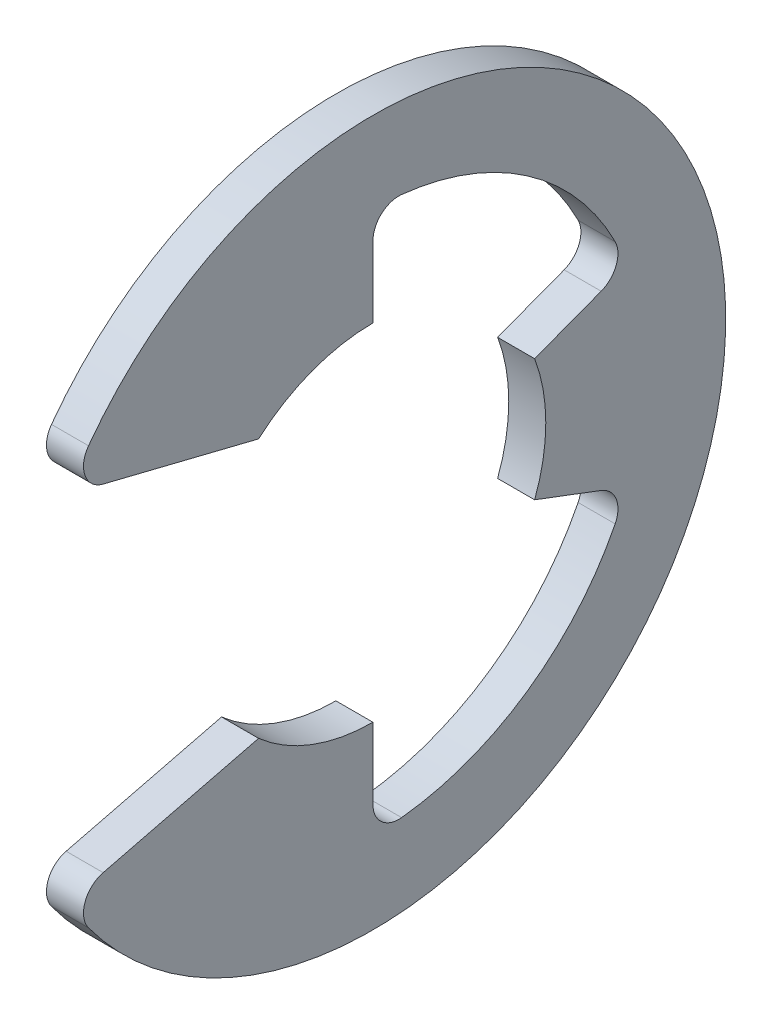
ISO-10303-21;
HEADER;
FILE_DESCRIPTION(('STEP AP214'),'2;1');
FILE_NAME('part.step','',(''),(''),'','','');
FILE_SCHEMA(('AUTOMOTIVE_DESIGN { 1 0 10303 214 1 1 1 1 }'));
ENDSEC;
DATA;
#1=APPLICATION_CONTEXT('core data for automotive mechanical design processes');
#2=APPLICATION_PROTOCOL_DEFINITION('international standard','automotive_design',2000,#1);
#3=PRODUCT_CONTEXT('',#1,'mechanical');
#4=PRODUCT('Part','Part','',(#3));
#5=PRODUCT_RELATED_PRODUCT_CATEGORY('part','',(#4));
#6=PRODUCT_DEFINITION_FORMATION('','',#4);
#7=PRODUCT_DEFINITION_CONTEXT('part definition',#1,'design');
#8=PRODUCT_DEFINITION('design','',#6,#7);
#9=PRODUCT_DEFINITION_SHAPE('','',#8);
#10=(LENGTH_UNIT() NAMED_UNIT(*) SI_UNIT(.MILLI.,.METRE.));
#11=(NAMED_UNIT(*) PLANE_ANGLE_UNIT() SI_UNIT($,.RADIAN.));
#12=(NAMED_UNIT(*) SI_UNIT($,.STERADIAN.) SOLID_ANGLE_UNIT());
#13=UNCERTAINTY_MEASURE_WITH_UNIT(LENGTH_MEASURE(1.E-05),#10,'distance_accuracy_value','');
#14=(GEOMETRIC_REPRESENTATION_CONTEXT(3) GLOBAL_UNCERTAINTY_ASSIGNED_CONTEXT((#13)) GLOBAL_UNIT_ASSIGNED_CONTEXT((#10,
#11,#12)) REPRESENTATION_CONTEXT('',''));
#15=CARTESIAN_POINT('',(0.,0.,0.));
#16=DIRECTION('',(0.,0.,1.));
#17=DIRECTION('',(1.,0.,0.));
#18=AXIS2_PLACEMENT_3D('',#15,#16,#17);
#19=CARTESIAN_POINT('',(0.533399999999962,0.,0.));
#20=DIRECTION('',(-1.,0.,0.));
#21=DIRECTION('',(0.,0.,1.00000000000001));
#22=AXIS2_PLACEMENT_3D('',#19,#20,#21);
#23=CYLINDRICAL_SURFACE('',#22,10.16);
#24=CARTESIAN_POINT('',(0.533399999999962,0.,0.));
#25=DIRECTION('',(1.,0.,0.));
#26=DIRECTION('',(0.,0.,-1.00000000000001));
#27=AXIS2_PLACEMENT_3D('',#24,#25,#26);
#28=CIRCLE('',#27,10.16);
#29=CARTESIAN_POINT('',(0.533399999999962,-6.01157023801036,8.19064242129236));
#30=VERTEX_POINT('',#29);
#31=CARTESIAN_POINT('',(0.533399999999962,6.0115702380106,8.19064242129246));
#32=VERTEX_POINT('',#31);
#33=EDGE_CURVE('E172',#30,#32,#28,.T.);
#34=ORIENTED_EDGE('',*,*,#33,.F.);
#35=DIRECTION('',(-1.,0.,0.));
#36=VECTOR('',#35,1.);
#37=CARTESIAN_POINT('',(0.533399999999962,-6.01157023801036,8.19064242129236));
#38=LINE('',#37,#36);
#39=CARTESIAN_POINT('',(-0.533400000000017,-6.01157023801036,8.19064242129236));
#40=VERTEX_POINT('',#39);
#41=EDGE_CURVE('E266',#30,#40,#38,.T.);
#42=ORIENTED_EDGE('',*,*,#41,.T.);
#43=CARTESIAN_POINT('',(-0.533399999999962,0.,0.));
#44=DIRECTION('',(1.,0.,0.));
#45=DIRECTION('',(0.,0.,-1.00000000000001));
#46=AXIS2_PLACEMENT_3D('',#43,#44,#45);
#47=CIRCLE('',#46,10.16);
#48=CARTESIAN_POINT('',(-0.533400000000017,6.0115702380106,8.19064242129246));
#49=VERTEX_POINT('',#48);
#50=EDGE_CURVE('E210',#40,#49,#47,.T.);
#51=ORIENTED_EDGE('',*,*,#50,.T.);
#52=DIRECTION('',(-1.,0.,0.));
#53=VECTOR('',#52,1.);
#54=CARTESIAN_POINT('',(0.533399999999962,6.0115702380106,8.19064242129246));
#55=LINE('',#54,#53);
#56=EDGE_CURVE('E264',#49,#32,#55,.F.);
#57=ORIENTED_EDGE('',*,*,#56,.T.);
#58=EDGE_LOOP('',(#34,#42,#51,#57));
#59=FACE_BOUND('',#58,.T.);
#60=ADVANCED_FACE('F34',(#59),#23,.T.);
#61=CARTESIAN_POINT('',(0.533399999999962,5.09813480407845,8.78832302088706));
#62=DIRECTION('',(0.,0.970536829925373,-0.24095282060687));
#63=DIRECTION('',(0.,0.240952820606878,0.970536829925378));
#64=AXIS2_PLACEMENT_3D('',#61,#62,#63);
#65=PLANE('',#64);
#66=DIRECTION('',(0.,-0.240952820606878,-0.970536829925378));
#67=VECTOR('',#66,1.);
#68=CARTESIAN_POINT('',(0.533399999999962,5.09813480407845,8.78832302088706));
#69=LINE('',#68,#67);
#70=CARTESIAN_POINT('',(0.533399999999962,4.84496174240151,7.76856413164388));
#71=VERTEX_POINT('',#70);
#72=CARTESIAN_POINT('',(0.533399999999962,3.73380000000001,3.29290208175144));
#73=VERTEX_POINT('',#72);
#74=EDGE_CURVE('E158',#71,#73,#69,.T.);
#75=ORIENTED_EDGE('',*,*,#74,.F.);
#76=DIRECTION('',(-1.,0.,0.));
#77=VECTOR('',#76,1.);
#78=CARTESIAN_POINT('',(0.533399999999962,4.84496174240151,7.76856413164388));
#79=LINE('',#78,#77);
#80=CARTESIAN_POINT('',(-0.533400000000017,4.84496174240151,7.76856413164388));
#81=VERTEX_POINT('',#80);
#82=EDGE_CURVE('E278',#71,#81,#79,.T.);
#83=ORIENTED_EDGE('',*,*,#82,.T.);
#84=DIRECTION('',(0.,-0.240952820606878,-0.970536829925378));
#85=VECTOR('',#84,1.);
#86=CARTESIAN_POINT('',(-0.533400000000017,5.09813480407845,8.78832302088706));
#87=LINE('',#86,#85);
#88=CARTESIAN_POINT('',(-0.533400000000017,3.73380000000001,3.29290208175144));
#89=VERTEX_POINT('',#88);
#90=EDGE_CURVE('E178',#81,#89,#87,.T.);
#91=ORIENTED_EDGE('',*,*,#90,.T.);
#92=DIRECTION('',(-1.,0.,0.));
#93=VECTOR('',#92,1.);
#94=CARTESIAN_POINT('',(0.533399999999962,3.73380000000001,3.29290208175144));
#95=LINE('',#94,#93);
#96=EDGE_CURVE('E175',#73,#89,#95,.T.);
#97=ORIENTED_EDGE('',*,*,#96,.F.);
#98=EDGE_LOOP('',(#75,#83,#91,#97));
#99=FACE_BOUND('',#98,.T.);
#100=ADVANCED_FACE('F176',(#99),#65,.F.);
#101=CARTESIAN_POINT('',(0.533399999999962,0.,0.));
#102=DIRECTION('',(-1.,0.,0.));
#103=DIRECTION('',(0.,0.,1.00000000000001));
#104=AXIS2_PLACEMENT_3D('',#101,#102,#103);
#105=CYLINDRICAL_SURFACE('',#104,4.9784);
#106=CARTESIAN_POINT('',(-0.533399999999962,0.,0.));
#107=DIRECTION('',(-1.,0.,0.));
#108=DIRECTION('',(0.,0.,1.00000000000001));
#109=AXIS2_PLACEMENT_3D('',#106,#107,#108);
#110=CIRCLE('',#109,4.9784);
#111=CARTESIAN_POINT('',(-0.533400000000184,4.97840000000035,3.33066907387547E-13));
#112=VERTEX_POINT('',#111);
#113=EDGE_CURVE('E214',#89,#112,#110,.T.);
#114=ORIENTED_EDGE('',*,*,#113,.T.);
#115=DIRECTION('',(-1.,0.,0.));
#116=VECTOR('',#115,1.);
#117=CARTESIAN_POINT('',(0.533399999999795,4.97840000000035,3.33066907387547E-13));
#118=LINE('',#117,#116);
#119=CARTESIAN_POINT('',(0.533399999999795,4.97840000000035,3.33066907387547E-13));
#120=VERTEX_POINT('',#119);
#121=EDGE_CURVE('E182',#120,#112,#118,.T.);
#122=ORIENTED_EDGE('',*,*,#121,.F.);
#123=CARTESIAN_POINT('',(0.533399999999962,0.,0.));
#124=DIRECTION('',(-1.,0.,0.));
#125=DIRECTION('',(0.,0.,1.00000000000001));
#126=AXIS2_PLACEMENT_3D('',#123,#124,#125);
#127=CIRCLE('',#126,4.9784);
#128=EDGE_CURVE('E164',#73,#120,#127,.T.);
#129=ORIENTED_EDGE('',*,*,#128,.F.);
#130=ORIENTED_EDGE('',*,*,#96,.T.);
#131=EDGE_LOOP('',(#114,#122,#129,#130));
#132=FACE_BOUND('',#131,.T.);
#133=ADVANCED_FACE('F184',(#132),#105,.F.);
#134=CARTESIAN_POINT('',(0.533399999999795,4.97840000000035,3.33066907387547E-13));
#135=DIRECTION('',(0.,0.,1.00000000000001));
#136=DIRECTION('',(0.,-1.,0.));
#137=AXIS2_PLACEMENT_3D('',#134,#135,#136);
#138=PLANE('',#137);
#139=DIRECTION('',(0.,1.,0.));
#140=VECTOR('',#139,1.);
#141=CARTESIAN_POINT('',(-0.533400000000184,4.97840000000035,3.33066907387547E-13));
#142=LINE('',#141,#140);
#143=CARTESIAN_POINT('',(-0.533400000000184,7.02704023617218,3.33066907387547E-13));
#144=VERTEX_POINT('',#143);
#145=EDGE_CURVE('E216',#112,#144,#142,.T.);
#146=ORIENTED_EDGE('',*,*,#145,.T.);
#147=DIRECTION('',(1.,0.,0.));
#148=VECTOR('',#147,1.);
#149=CARTESIAN_POINT('',(0.533399999999795,7.02704023617218,3.33066907387547E-13));
#150=LINE('',#149,#148);
#151=CARTESIAN_POINT('',(0.533399999999795,7.02704023617218,3.33066907387547E-13));
#152=VERTEX_POINT('',#151);
#153=EDGE_CURVE('E262',#144,#152,#150,.T.);
#154=ORIENTED_EDGE('',*,*,#153,.T.);
#155=DIRECTION('',(0.,1.,0.));
#156=VECTOR('',#155,1.);
#157=CARTESIAN_POINT('',(0.533399999999795,4.97840000000035,3.33066907387547E-13));
#158=LINE('',#157,#156);
#159=EDGE_CURVE('E187',#120,#152,#158,.T.);
#160=ORIENTED_EDGE('',*,*,#159,.F.);
#161=ORIENTED_EDGE('',*,*,#121,.T.);
#162=EDGE_LOOP('',(#146,#154,#160,#161));
#163=FACE_BOUND('',#162,.T.);
#164=ADVANCED_FACE('F384',(#163),#138,.F.);
#165=CARTESIAN_POINT('',(0.533399999999962,0.,0.));
#166=DIRECTION('',(-1.,0.,0.));
#167=DIRECTION('',(0.,0.,1.00000000000001));
#168=AXIS2_PLACEMENT_3D('',#165,#166,#167);
#169=CYLINDRICAL_SURFACE('',#168,7.81336774193549);
#170=CARTESIAN_POINT('',(0.533399999999962,0.,0.));
#171=DIRECTION('',(-1.,0.,0.));
#172=DIRECTION('',(0.,0.,-1.00000000000001));
#173=AXIS2_PLACEMENT_3D('',#170,#171,#172);
#174=CIRCLE('',#173,7.81336774193549);
#175=CARTESIAN_POINT('',(0.533399999999962,7.76961896112755,-0.825673464276588));
#176=VERTEX_POINT('',#175);
#177=CARTESIAN_POINT('',(0.533400000000017,3.5193219314931,-6.97589339176204));
#178=VERTEX_POINT('',#177);
#179=EDGE_CURVE('E189',#176,#178,#174,.T.);
#180=ORIENTED_EDGE('',*,*,#179,.F.);
#181=DIRECTION('',(-1.,0.,0.));
#182=VECTOR('',#181,1.);
#183=CARTESIAN_POINT('',(0.533399999999962,7.76961896112755,-0.825673464276588));
#184=LINE('',#183,#182);
#185=CARTESIAN_POINT('',(-0.533400000000017,7.76961896112755,-0.825673464276616));
#186=VERTEX_POINT('',#185);
#187=EDGE_CURVE('E259',#176,#186,#184,.T.);
#188=ORIENTED_EDGE('',*,*,#187,.T.);
#189=CARTESIAN_POINT('',(-0.533399999999962,0.,0.));
#190=DIRECTION('',(-1.,0.,0.));
#191=DIRECTION('',(0.,0.,-1.00000000000001));
#192=AXIS2_PLACEMENT_3D('',#189,#190,#191);
#193=CIRCLE('',#192,7.81336774193549);
#194=CARTESIAN_POINT('',(-0.533400000000017,3.5193219314931,-6.97589339176204));
#195=VERTEX_POINT('',#194);
#196=EDGE_CURVE('E219',#186,#195,#193,.T.);
#197=ORIENTED_EDGE('',*,*,#196,.T.);
#198=DIRECTION('',(-1.,0.,0.));
#199=VECTOR('',#198,1.);
#200=CARTESIAN_POINT('',(0.533400000000017,3.5193219314931,-6.97589339176204));
#201=LINE('',#200,#199);
#202=EDGE_CURVE('E257',#195,#178,#201,.F.);
#203=ORIENTED_EDGE('',*,*,#202,.T.);
#204=EDGE_LOOP('',(#180,#188,#197,#203));
#205=FACE_BOUND('',#204,.T.);
#206=ADVANCED_FACE('F306',(#205),#169,.F.);
#207=CARTESIAN_POINT('',(0.533400000000017,1.76013019972987,-4.65686678357836));
#208=DIRECTION('',(0.,-0.935414346693487,-0.353553390593281));
#209=DIRECTION('',(0.,0.353553390593271,-0.935414346693489));
#210=AXIS2_PLACEMENT_3D('',#207,#208,#209);
#211=PLANE('',#210);
#212=DIRECTION('',(0.,-0.353553390593271,0.935414346693489));
#213=VECTOR('',#212,1.);
#214=CARTESIAN_POINT('',(0.533400000000017,1.76013019972987,-4.65686678357836));
#215=LINE('',#214,#213);
#216=CARTESIAN_POINT('',(0.533400000000017,2.48443390133452,-6.57319425170749));
#217=VERTEX_POINT('',#216);
#218=CARTESIAN_POINT('',(0.533400000000017,1.76013019972987,-4.65686678357836));
#219=VERTEX_POINT('',#218);
#220=EDGE_CURVE('E194',#217,#219,#215,.T.);
#221=ORIENTED_EDGE('',*,*,#220,.F.);
#222=DIRECTION('',(1.,0.,0.));
#223=VECTOR('',#222,1.);
#224=CARTESIAN_POINT('',(-0.533400000000017,2.48443390133452,-6.57319425170749));
#225=LINE('',#224,#223);
#226=CARTESIAN_POINT('',(-0.533400000000017,2.48443390133452,-6.57319425170749));
#227=VERTEX_POINT('',#226);
#228=EDGE_CURVE('E281',#217,#227,#225,.F.);
#229=ORIENTED_EDGE('',*,*,#228,.T.);
#230=DIRECTION('',(0.,-0.353553390593271,0.935414346693489));
#231=VECTOR('',#230,1.);
#232=CARTESIAN_POINT('',(-0.533400000000017,1.76013019972987,-4.65686678357831));
#233=LINE('',#232,#231);
#234=CARTESIAN_POINT('',(-0.533400000000017,1.76013019972987,-4.65686678357831));
#235=VERTEX_POINT('',#234);
#236=EDGE_CURVE('E222',#227,#235,#233,.T.);
#237=ORIENTED_EDGE('',*,*,#236,.T.);
#238=DIRECTION('',(-1.,0.,0.));
#239=VECTOR('',#238,1.);
#240=CARTESIAN_POINT('',(0.533400000000017,1.76013019972987,-4.65686678357836));
#241=LINE('',#240,#239);
#242=EDGE_CURVE('E246',#219,#235,#241,.T.);
#243=ORIENTED_EDGE('',*,*,#242,.F.);
#244=EDGE_LOOP('',(#221,#229,#237,#243));
#245=FACE_BOUND('',#244,.T.);
#246=ADVANCED_FACE('F309',(#245),#211,.F.);
#247=CARTESIAN_POINT('',(0.533399999999962,0.,0.));
#248=DIRECTION('',(-1.,0.,0.));
#249=DIRECTION('',(0.,0.,1.00000000000001));
#250=AXIS2_PLACEMENT_3D('',#247,#248,#249);
#251=CYLINDRICAL_SURFACE('',#250,4.9784);
#252=CARTESIAN_POINT('',(-0.533399999999962,0.,0.));
#253=DIRECTION('',(-1.,0.,0.));
#254=DIRECTION('',(0.,0.,1.00000000000001));
#255=AXIS2_PLACEMENT_3D('',#252,#253,#254);
#256=CIRCLE('',#255,4.9784);
#257=CARTESIAN_POINT('',(-0.533400000000017,-1.7601301997289,-4.65686678357852));
#258=VERTEX_POINT('',#257);
#259=EDGE_CURVE('E224',#235,#258,#256,.T.);
#260=ORIENTED_EDGE('',*,*,#259,.T.);
#261=DIRECTION('',(-1.,0.,0.));
#262=VECTOR('',#261,1.);
#263=CARTESIAN_POINT('',(0.533400000000017,-1.7601301997289,-4.65686678357852));
#264=LINE('',#263,#262);
#265=CARTESIAN_POINT('',(0.533400000000017,-1.7601301997289,-4.65686678357852));
#266=VERTEX_POINT('',#265);
#267=EDGE_CURVE('E243',#266,#258,#264,.T.);
#268=ORIENTED_EDGE('',*,*,#267,.F.);
#269=CARTESIAN_POINT('',(0.533399999999962,0.,0.));
#270=DIRECTION('',(-1.,0.,0.));
#271=DIRECTION('',(0.,0.,1.00000000000001));
#272=AXIS2_PLACEMENT_3D('',#269,#270,#271);
#273=CIRCLE('',#272,4.9784);
#274=EDGE_CURVE('E196',#219,#266,#273,.T.);
#275=ORIENTED_EDGE('',*,*,#274,.F.);
#276=ORIENTED_EDGE('',*,*,#242,.T.);
#277=EDGE_LOOP('',(#260,#268,#275,#276));
#278=FACE_BOUND('',#277,.T.);
#279=ADVANCED_FACE('F315',(#278),#251,.F.);
#280=CARTESIAN_POINT('',(0.533400000000017,-1.7601301997289,-4.65686678357852));
#281=DIRECTION('',(0.,0.935414346693485,-0.353553390593272));
#282=DIRECTION('',(0.,0.353553390593279,0.935414346693492));
#283=AXIS2_PLACEMENT_3D('',#280,#281,#282);
#284=PLANE('',#283);
#285=DIRECTION('',(0.,-0.353553390593279,-0.935414346693492));
#286=VECTOR('',#285,1.);
#287=CARTESIAN_POINT('',(-0.533400000000017,-1.7601301997289,-4.65686678357852));
#288=LINE('',#287,#286);
#289=CARTESIAN_POINT('',(-0.533400000000017,-2.48443390133338,-6.5731942517078));
#290=VERTEX_POINT('',#289);
#291=EDGE_CURVE('E226',#258,#290,#288,.T.);
#292=ORIENTED_EDGE('',*,*,#291,.T.);
#293=DIRECTION('',(1.,0.,0.));
#294=VECTOR('',#293,1.);
#295=CARTESIAN_POINT('',(0.533400000000017,-2.48443390133338,-6.5731942517078));
#296=LINE('',#295,#294);
#297=CARTESIAN_POINT('',(0.533400000000017,-2.48443390133338,-6.5731942517078));
#298=VERTEX_POINT('',#297);
#299=EDGE_CURVE('E49',#290,#298,#296,.T.);
#300=ORIENTED_EDGE('',*,*,#299,.T.);
#301=DIRECTION('',(0.,-0.353553390593279,-0.935414346693492));
#302=VECTOR('',#301,1.);
#303=CARTESIAN_POINT('',(0.533400000000017,-1.7601301997289,-4.65686678357852));
#304=LINE('',#303,#302);
#305=EDGE_CURVE('E198',#266,#298,#304,.T.);
#306=ORIENTED_EDGE('',*,*,#305,.F.);
#307=ORIENTED_EDGE('',*,*,#267,.T.);
#308=EDGE_LOOP('',(#292,#300,#306,#307));
#309=FACE_BOUND('',#308,.T.);
#310=ADVANCED_FACE('F317',(#309),#284,.F.);
#311=CARTESIAN_POINT('',(0.533399999999962,0.,0.));
#312=DIRECTION('',(-1.,0.,0.));
#313=DIRECTION('',(0.,0.,1.00000000000001));
#314=AXIS2_PLACEMENT_3D('',#311,#312,#313);
#315=CYLINDRICAL_SURFACE('',#314,7.81336774193548);
#316=CARTESIAN_POINT('',(-0.533399999999962,0.,0.));
#317=DIRECTION('',(-1.,0.,0.));
#318=DIRECTION('',(0.,0.,-1.00000000000001));
#319=AXIS2_PLACEMENT_3D('',#316,#317,#318);
#320=CIRCLE('',#319,7.81336774193548);
#321=CARTESIAN_POINT('',(-0.533400000000017,-3.51932193149307,-6.97589339176179));
#322=VERTEX_POINT('',#321);
#323=CARTESIAN_POINT('',(-0.533400000000017,-7.76961896112688,-0.825673464276283));
#324=VERTEX_POINT('',#323);
#325=EDGE_CURVE('E228',#322,#324,#320,.T.);
#326=ORIENTED_EDGE('',*,*,#325,.T.);
#327=DIRECTION('',(-1.,0.,0.));
#328=VECTOR('',#327,1.);
#329=CARTESIAN_POINT('',(0.533399999999962,-7.76961896112688,-0.825673464276283));
#330=LINE('',#329,#328);
#331=CARTESIAN_POINT('',(0.533399999999962,-7.76961896112688,-0.825673464276283));
#332=VERTEX_POINT('',#331);
#333=EDGE_CURVE('E255',#324,#332,#330,.F.);
#334=ORIENTED_EDGE('',*,*,#333,.T.);
#335=CARTESIAN_POINT('',(0.533399999999962,0.,0.));
#336=DIRECTION('',(-1.,0.,0.));
#337=DIRECTION('',(0.,0.,-1.00000000000001));
#338=AXIS2_PLACEMENT_3D('',#335,#336,#337);
#339=CIRCLE('',#338,7.81336774193548);
#340=CARTESIAN_POINT('',(0.533400000000017,-3.51932193149307,-6.97589339176179));
#341=VERTEX_POINT('',#340);
#342=EDGE_CURVE('E200',#341,#332,#339,.T.);
#343=ORIENTED_EDGE('',*,*,#342,.F.);
#344=DIRECTION('',(-1.,0.,0.));
#345=VECTOR('',#344,1.);
#346=CARTESIAN_POINT('',(0.533400000000017,-3.51932193149307,-6.97589339176179));
#347=LINE('',#346,#345);
#348=EDGE_CURVE('E252',#341,#322,#347,.T.);
#349=ORIENTED_EDGE('',*,*,#348,.T.);
#350=EDGE_LOOP('',(#326,#334,#343,#349));
#351=FACE_BOUND('',#350,.T.);
#352=ADVANCED_FACE('F319',(#351),#315,.F.);
#353=CARTESIAN_POINT('',(0.533400000000017,-4.97839999999969,3.33066907387547E-13));
#354=DIRECTION('',(0.,0.,1.00000000000001));
#355=DIRECTION('',(0.,-1.,0.));
#356=AXIS2_PLACEMENT_3D('',#353,#354,#355);
#357=PLANE('',#356);
#358=DIRECTION('',(0.,1.,0.));
#359=VECTOR('',#358,1.);
#360=CARTESIAN_POINT('',(0.533400000000017,-4.97839999999969,3.33066907387547E-13));
#361=LINE('',#360,#359);
#362=CARTESIAN_POINT('',(0.533400000000017,-7.02704023617182,3.33066907387547E-13));
#363=VERTEX_POINT('',#362);
#364=CARTESIAN_POINT('',(0.533400000000017,-4.97839999999969,3.33066907387547E-13));
#365=VERTEX_POINT('',#364);
#366=EDGE_CURVE('E203',#363,#365,#361,.T.);
#367=ORIENTED_EDGE('',*,*,#366,.F.);
#368=DIRECTION('',(1.,0.,0.));
#369=VECTOR('',#368,1.);
#370=CARTESIAN_POINT('',(-0.533399999999962,-7.02704023617182,3.33066907387547E-13));
#371=LINE('',#370,#369);
#372=CARTESIAN_POINT('',(-0.533399999999962,-7.02704023617182,3.33066907387547E-13));
#373=VERTEX_POINT('',#372);
#374=EDGE_CURVE('E181',#363,#373,#371,.F.);
#375=ORIENTED_EDGE('',*,*,#374,.T.);
#376=DIRECTION('',(0.,1.,0.));
#377=VECTOR('',#376,1.);
#378=CARTESIAN_POINT('',(-0.533399999999962,-4.97839999999969,3.33066907387547E-13));
#379=LINE('',#378,#377);
#380=CARTESIAN_POINT('',(-0.533399999999962,-4.97839999999969,3.33066907387547E-13));
#381=VERTEX_POINT('',#380);
#382=EDGE_CURVE('E231',#373,#381,#379,.T.);
#383=ORIENTED_EDGE('',*,*,#382,.T.);
#384=DIRECTION('',(-1.,0.,0.));
#385=VECTOR('',#384,1.);
#386=CARTESIAN_POINT('',(0.533400000000017,-4.97839999999969,3.33066907387547E-13));
#387=LINE('',#386,#385);
#388=EDGE_CURVE('E240',#365,#381,#387,.T.);
#389=ORIENTED_EDGE('',*,*,#388,.F.);
#390=EDGE_LOOP('',(#367,#375,#383,#389));
#391=FACE_BOUND('',#390,.T.);
#392=ADVANCED_FACE('F325',(#391),#357,.F.);
#393=CARTESIAN_POINT('',(0.533399999999962,0.,0.));
#394=DIRECTION('',(-1.,0.,0.));
#395=DIRECTION('',(0.,0.,1.00000000000001));
#396=AXIS2_PLACEMENT_3D('',#393,#394,#395);
#397=CYLINDRICAL_SURFACE('',#396,4.9784);
#398=CARTESIAN_POINT('',(-0.533399999999962,0.,0.));
#399=DIRECTION('',(-1.,0.,0.));
#400=DIRECTION('',(0.,0.,-1.00000000000001));
#401=AXIS2_PLACEMENT_3D('',#398,#399,#400);
#402=CIRCLE('',#401,4.9784);
#403=CARTESIAN_POINT('',(-0.533400000000017,-3.73379999999968,3.29290208175101));
#404=VERTEX_POINT('',#403);
#405=EDGE_CURVE('E233',#381,#404,#402,.T.);
#406=ORIENTED_EDGE('',*,*,#405,.T.);
#407=DIRECTION('',(-1.,0.,0.));
#408=VECTOR('',#407,1.);
#409=CARTESIAN_POINT('',(0.533399999999962,-3.73379999999968,3.29290208175101));
#410=LINE('',#409,#408);
#411=CARTESIAN_POINT('',(0.533399999999962,-3.73379999999968,3.29290208175101));
#412=VERTEX_POINT('',#411);
#413=EDGE_CURVE('E209',#412,#404,#410,.T.);
#414=ORIENTED_EDGE('',*,*,#413,.F.);
#415=CARTESIAN_POINT('',(0.533399999999962,0.,0.));
#416=DIRECTION('',(-1.,0.,0.));
#417=DIRECTION('',(0.,0.,-1.00000000000001));
#418=AXIS2_PLACEMENT_3D('',#415,#416,#417);
#419=CIRCLE('',#418,4.9784);
#420=EDGE_CURVE('E205',#365,#412,#419,.T.);
#421=ORIENTED_EDGE('',*,*,#420,.F.);
#422=ORIENTED_EDGE('',*,*,#388,.T.);
#423=EDGE_LOOP('',(#406,#414,#421,#422));
#424=FACE_BOUND('',#423,.T.);
#425=ADVANCED_FACE('F374',(#424),#397,.F.);
#426=CARTESIAN_POINT('',(0.533399999999962,-5.09813480407778,8.78832302088703));
#427=DIRECTION('',(0.,-0.970536829925374,-0.240952820606879));
#428=DIRECTION('',(0.,0.240952820606868,-0.970536829925378));
#429=AXIS2_PLACEMENT_3D('',#426,#427,#428);
#430=PLANE('',#429);
#431=DIRECTION('',(0.,-0.240952820606868,0.970536829925378));
#432=VECTOR('',#431,1.);
#433=CARTESIAN_POINT('',(-0.533400000000017,-5.09813480407778,8.78832302088703));
#434=LINE('',#433,#432);
#435=CARTESIAN_POINT('',(-0.533400000000017,-4.84496174240154,7.76856413164376));
#436=VERTEX_POINT('',#435);
#437=EDGE_CURVE('E235',#404,#436,#434,.T.);
#438=ORIENTED_EDGE('',*,*,#437,.T.);
#439=DIRECTION('',(-1.,0.,0.));
#440=VECTOR('',#439,1.);
#441=CARTESIAN_POINT('',(0.533399999999962,-4.84496174240154,7.76856413164376));
#442=LINE('',#441,#440);
#443=CARTESIAN_POINT('',(0.533399999999962,-4.84496174240154,7.76856413164376));
#444=VERTEX_POINT('',#443);
#445=EDGE_CURVE('E273',#436,#444,#442,.F.);
#446=ORIENTED_EDGE('',*,*,#445,.T.);
#447=DIRECTION('',(0.,-0.240952820606868,0.970536829925378));
#448=VECTOR('',#447,1.);
#449=CARTESIAN_POINT('',(0.533399999999962,-5.09813480407778,8.78832302088703));
#450=LINE('',#449,#448);
#451=EDGE_CURVE('E207',#412,#444,#450,.T.);
#452=ORIENTED_EDGE('',*,*,#451,.F.);
#453=ORIENTED_EDGE('',*,*,#413,.T.);
#454=EDGE_LOOP('',(#438,#446,#452,#453));
#455=FACE_BOUND('',#454,.T.);
#456=ADVANCED_FACE('F423',(#455),#430,.F.);
#457=CARTESIAN_POINT('',(0.533399999999962,0.,0.));
#458=DIRECTION('',(1.,0.,0.));
#459=DIRECTION('',(0.,0.,-1.00000000000001));
#460=AXIS2_PLACEMENT_3D('',#457,#458,#459);
#461=PLANE('',#460);
#462=ORIENTED_EDGE('',*,*,#451,.T.);
#463=CARTESIAN_POINT('',(0.533399999999962,-5.5697198255166,7.58863020332706));
#464=DIRECTION('',(1.,0.,0.));
#465=DIRECTION('',(0.,0.,-1.00000000000001));
#466=AXIS2_PLACEMENT_3D('',#463,#464,#465);
#467=CIRCLE('',#466,0.74676);
#468=EDGE_CURVE('E276',#444,#30,#467,.T.);
#469=ORIENTED_EDGE('',*,*,#468,.T.);
#470=ORIENTED_EDGE('',*,*,#33,.T.);
#471=CARTESIAN_POINT('',(0.533399999999962,5.56971982551693,7.58863020332694));
#472=DIRECTION('',(1.,0.,0.));
#473=DIRECTION('',(0.,0.,-1.00000000000001));
#474=AXIS2_PLACEMENT_3D('',#471,#472,#473);
#475=CIRCLE('',#474,0.74676);
#476=EDGE_CURVE('E168',#32,#71,#475,.T.);
#477=ORIENTED_EDGE('',*,*,#476,.T.);
#478=ORIENTED_EDGE('',*,*,#74,.T.);
#479=ORIENTED_EDGE('',*,*,#128,.T.);
#480=ORIENTED_EDGE('',*,*,#159,.T.);
#481=CARTESIAN_POINT('',(0.533399999999962,7.02704023617223,-0.74675999999968));
#482=DIRECTION('',(1.,0.,0.));
#483=DIRECTION('',(0.,0.,-1.00000000000001));
#484=AXIS2_PLACEMENT_3D('',#481,#482,#483);
#485=CIRCLE('',#484,0.74676);
#486=EDGE_CURVE('E290',#152,#176,#485,.F.);
#487=ORIENTED_EDGE('',*,*,#486,.T.);
#488=ORIENTED_EDGE('',*,*,#179,.T.);
#489=CARTESIAN_POINT('',(0.533400000000017,3.18296391887118,-6.30917472174838));
#490=DIRECTION('',(1.,0.,0.));
#491=DIRECTION('',(0.,0.,-1.00000000000001));
#492=AXIS2_PLACEMENT_3D('',#489,#490,#491);
#493=CIRCLE('',#492,0.74676);
#494=EDGE_CURVE('E11',#178,#217,#493,.F.);
#495=ORIENTED_EDGE('',*,*,#494,.T.);
#496=ORIENTED_EDGE('',*,*,#220,.T.);
#497=ORIENTED_EDGE('',*,*,#274,.T.);
#498=ORIENTED_EDGE('',*,*,#305,.T.);
#499=CARTESIAN_POINT('',(0.533400000000017,-3.18296391887085,-6.30917472174826));
#500=DIRECTION('',(1.,0.,0.));
#501=DIRECTION('',(0.,0.,-1.00000000000001));
#502=AXIS2_PLACEMENT_3D('',#499,#500,#501);
#503=CIRCLE('',#502,0.74676);
#504=EDGE_CURVE('E294',#298,#341,#503,.F.);
#505=ORIENTED_EDGE('',*,*,#504,.T.);
#506=ORIENTED_EDGE('',*,*,#342,.T.);
#507=CARTESIAN_POINT('',(0.533399999999962,-7.02704023617215,-0.74675999999968));
#508=DIRECTION('',(1.,0.,0.));
#509=DIRECTION('',(0.,0.,-1.00000000000001));
#510=AXIS2_PLACEMENT_3D('',#507,#508,#509);
#511=CIRCLE('',#510,0.74676);
#512=EDGE_CURVE('E286',#332,#363,#511,.F.);
#513=ORIENTED_EDGE('',*,*,#512,.T.);
#514=ORIENTED_EDGE('',*,*,#366,.T.);
#515=ORIENTED_EDGE('',*,*,#420,.T.);
#516=EDGE_LOOP('',(#462,#469,#470,#477,#478,#479,#480,#487,#488,#495,#496,#497,#498,#505,#506,
#513,#514,#515));
#517=FACE_BOUND('',#516,.T.);
#518=ADVANCED_FACE('F161',(#517),#461,.T.);
#519=CARTESIAN_POINT('',(-0.533399999999962,0.,0.));
#520=DIRECTION('',(1.,0.,0.));
#521=DIRECTION('',(0.,0.,-1.00000000000001));
#522=AXIS2_PLACEMENT_3D('',#519,#520,#521);
#523=PLANE('',#522);
#524=ORIENTED_EDGE('',*,*,#50,.F.);
#525=CARTESIAN_POINT('',(-0.533400000000017,-5.5697198255166,7.58863020332706));
#526=DIRECTION('',(1.,0.,0.));
#527=DIRECTION('',(0.,0.,-1.00000000000001));
#528=AXIS2_PLACEMENT_3D('',#525,#526,#527);
#529=CIRCLE('',#528,0.74676);
#530=EDGE_CURVE('E271',#40,#436,#529,.F.);
#531=ORIENTED_EDGE('',*,*,#530,.T.);
#532=ORIENTED_EDGE('',*,*,#437,.F.);
#533=ORIENTED_EDGE('',*,*,#405,.F.);
#534=ORIENTED_EDGE('',*,*,#382,.F.);
#535=CARTESIAN_POINT('',(-0.533400000000017,-7.02704023617215,-0.74675999999968));
#536=DIRECTION('',(1.,0.,0.));
#537=DIRECTION('',(0.,0.,-1.00000000000001));
#538=AXIS2_PLACEMENT_3D('',#535,#536,#537);
#539=CIRCLE('',#538,0.74676);
#540=EDGE_CURVE('E284',#373,#324,#539,.T.);
#541=ORIENTED_EDGE('',*,*,#540,.T.);
#542=ORIENTED_EDGE('',*,*,#325,.F.);
#543=CARTESIAN_POINT('',(-0.533400000000017,-3.18296391887085,-6.30917472174826));
#544=DIRECTION('',(1.,0.,0.));
#545=DIRECTION('',(0.,0.,-1.00000000000001));
#546=AXIS2_PLACEMENT_3D('',#543,#544,#545);
#547=CIRCLE('',#546,0.74676);
#548=EDGE_CURVE('E292',#322,#290,#547,.T.);
#549=ORIENTED_EDGE('',*,*,#548,.T.);
#550=ORIENTED_EDGE('',*,*,#291,.F.);
#551=ORIENTED_EDGE('',*,*,#259,.F.);
#552=ORIENTED_EDGE('',*,*,#236,.F.);
#553=CARTESIAN_POINT('',(-0.533400000000017,3.18296391887118,-6.30917472174838));
#554=DIRECTION('',(1.,0.,0.));
#555=DIRECTION('',(0.,0.,-1.00000000000001));
#556=AXIS2_PLACEMENT_3D('',#553,#554,#555);
#557=CIRCLE('',#556,0.74676);
#558=EDGE_CURVE('E42',#227,#195,#557,.T.);
#559=ORIENTED_EDGE('',*,*,#558,.T.);
#560=ORIENTED_EDGE('',*,*,#196,.F.);
#561=CARTESIAN_POINT('',(-0.533400000000017,7.02704023617223,-0.74675999999968));
#562=DIRECTION('',(1.,0.,0.));
#563=DIRECTION('',(0.,0.,-1.00000000000001));
#564=AXIS2_PLACEMENT_3D('',#561,#562,#563);
#565=CIRCLE('',#564,0.74676);
#566=EDGE_CURVE('E288',#186,#144,#565,.T.);
#567=ORIENTED_EDGE('',*,*,#566,.T.);
#568=ORIENTED_EDGE('',*,*,#145,.F.);
#569=ORIENTED_EDGE('',*,*,#113,.F.);
#570=ORIENTED_EDGE('',*,*,#90,.F.);
#571=CARTESIAN_POINT('',(-0.533400000000017,5.56971982551693,7.58863020332694));
#572=DIRECTION('',(1.,0.,0.));
#573=DIRECTION('',(0.,0.,-1.00000000000001));
#574=AXIS2_PLACEMENT_3D('',#571,#572,#573);
#575=CIRCLE('',#574,0.74676);
#576=EDGE_CURVE('E269',#81,#49,#575,.F.);
#577=ORIENTED_EDGE('',*,*,#576,.T.);
#578=EDGE_LOOP('',(#524,#531,#532,#533,#534,#541,#542,#549,#550,#551,#552,#559,#560,#567,#568,
#569,#570,#577));
#579=FACE_BOUND('',#578,.T.);
#580=ADVANCED_FACE('F299',(#579),#523,.F.);
#581=CARTESIAN_POINT('',(0.533399999999962,-7.02704023617215,-0.74675999999968));
#582=DIRECTION('',(-1.,0.,0.));
#583=DIRECTION('',(0.,0.,1.00000000000001));
#584=AXIS2_PLACEMENT_3D('',#581,#582,#583);
#585=CYLINDRICAL_SURFACE('',#584,0.74676);
#586=ORIENTED_EDGE('',*,*,#512,.F.);
#587=ORIENTED_EDGE('',*,*,#333,.F.);
#588=ORIENTED_EDGE('',*,*,#540,.F.);
#589=ORIENTED_EDGE('',*,*,#374,.F.);
#590=EDGE_LOOP('',(#586,#587,#588,#589));
#591=FACE_BOUND('',#590,.T.);
#592=ADVANCED_FACE('F339',(#591),#585,.F.);
#593=CARTESIAN_POINT('',(0.533399999999962,7.02704023617223,-0.74675999999968));
#594=DIRECTION('',(-1.,0.,0.));
#595=DIRECTION('',(0.,0.,1.00000000000001));
#596=AXIS2_PLACEMENT_3D('',#593,#594,#595);
#597=CYLINDRICAL_SURFACE('',#596,0.74676);
#598=ORIENTED_EDGE('',*,*,#486,.F.);
#599=ORIENTED_EDGE('',*,*,#153,.F.);
#600=ORIENTED_EDGE('',*,*,#566,.F.);
#601=ORIENTED_EDGE('',*,*,#187,.F.);
#602=EDGE_LOOP('',(#598,#599,#600,#601));
#603=FACE_BOUND('',#602,.T.);
#604=ADVANCED_FACE('F342',(#603),#597,.F.);
#605=CARTESIAN_POINT('',(0.533399999999962,-5.5697198255166,7.58863020332706));
#606=DIRECTION('',(-1.,0.,0.));
#607=DIRECTION('',(0.,0.,1.00000000000001));
#608=AXIS2_PLACEMENT_3D('',#605,#606,#607);
#609=CYLINDRICAL_SURFACE('',#608,0.74676);
#610=ORIENTED_EDGE('',*,*,#468,.F.);
#611=ORIENTED_EDGE('',*,*,#445,.F.);
#612=ORIENTED_EDGE('',*,*,#530,.F.);
#613=ORIENTED_EDGE('',*,*,#41,.F.);
#614=EDGE_LOOP('',(#610,#611,#612,#613));
#615=FACE_BOUND('',#614,.T.);
#616=ADVANCED_FACE('F346',(#615),#609,.T.);
#617=CARTESIAN_POINT('',(0.533399999999962,5.56971982551693,7.58863020332694));
#618=DIRECTION('',(-1.,0.,0.));
#619=DIRECTION('',(0.,0.,1.00000000000001));
#620=AXIS2_PLACEMENT_3D('',#617,#618,#619);
#621=CYLINDRICAL_SURFACE('',#620,0.74676);
#622=ORIENTED_EDGE('',*,*,#476,.F.);
#623=ORIENTED_EDGE('',*,*,#56,.F.);
#624=ORIENTED_EDGE('',*,*,#576,.F.);
#625=ORIENTED_EDGE('',*,*,#82,.F.);
#626=EDGE_LOOP('',(#622,#623,#624,#625));
#627=FACE_BOUND('',#626,.T.);
#628=ADVANCED_FACE('F350',(#627),#621,.T.);
#629=CARTESIAN_POINT('',(0.533400000000017,-3.18296391887085,-6.30917472174826));
#630=DIRECTION('',(-1.,0.,0.));
#631=DIRECTION('',(0.,0.,1.00000000000001));
#632=AXIS2_PLACEMENT_3D('',#629,#630,#631);
#633=CYLINDRICAL_SURFACE('',#632,0.74676);
#634=ORIENTED_EDGE('',*,*,#504,.F.);
#635=ORIENTED_EDGE('',*,*,#299,.F.);
#636=ORIENTED_EDGE('',*,*,#548,.F.);
#637=ORIENTED_EDGE('',*,*,#348,.F.);
#638=EDGE_LOOP('',(#634,#635,#636,#637));
#639=FACE_BOUND('',#638,.T.);
#640=ADVANCED_FACE('F353',(#639),#633,.F.);
#641=CARTESIAN_POINT('',(0.533400000000017,3.18296391887118,-6.30917472174838));
#642=DIRECTION('',(-1.,0.,0.));
#643=DIRECTION('',(0.,0.,1.00000000000001));
#644=AXIS2_PLACEMENT_3D('',#641,#642,#643);
#645=CYLINDRICAL_SURFACE('',#644,0.74676);
#646=ORIENTED_EDGE('',*,*,#494,.F.);
#647=ORIENTED_EDGE('',*,*,#202,.F.);
#648=ORIENTED_EDGE('',*,*,#558,.F.);
#649=ORIENTED_EDGE('',*,*,#228,.F.);
#650=EDGE_LOOP('',(#646,#647,#648,#649));
#651=FACE_BOUND('',#650,.T.);
#652=ADVANCED_FACE('F36',(#651),#645,.F.);
#653=CLOSED_SHELL('',(#60,#100,#133,#164,#206,#246,#279,#310,#352,#392,#425,#456,#518,#580,#592,
#604,#616,#628,#640,#652));
#654=MANIFOLD_SOLID_BREP('B2',#653);
#655=ADVANCED_BREP_SHAPE_REPRESENTATION('',(#18,#654),#14);
#656=SHAPE_DEFINITION_REPRESENTATION(#9,#655);
ENDSEC;
END-ISO-10303-21;
